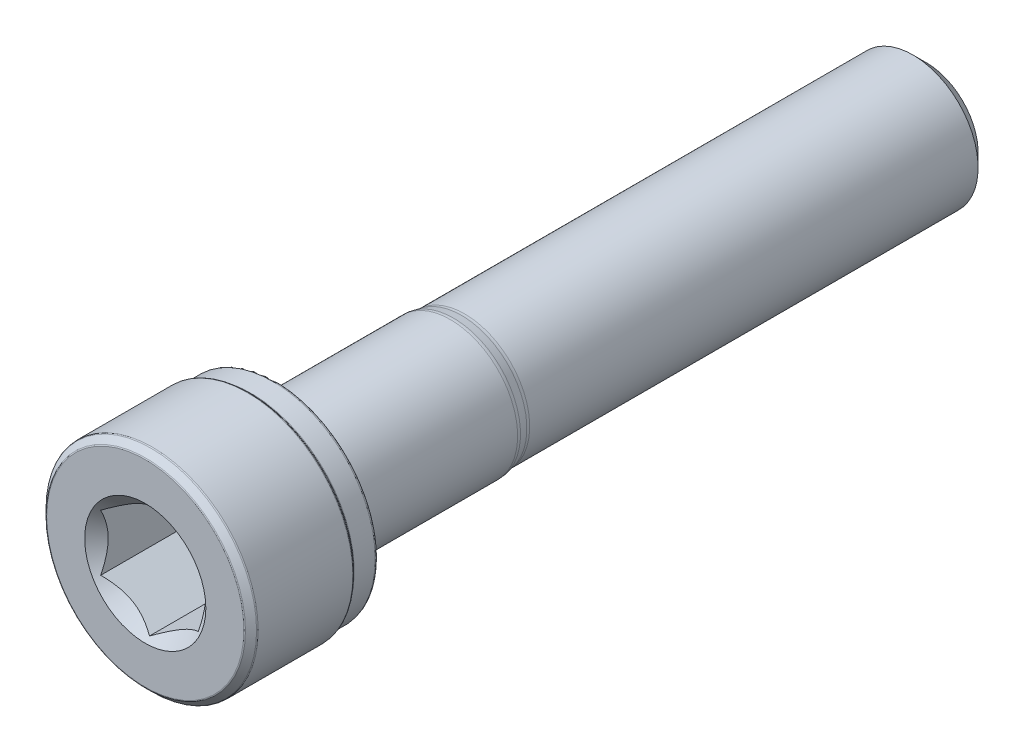
ISO-10303-21;
HEADER;
FILE_DESCRIPTION(('STEP AP214'),'2;1');
FILE_NAME('part.step','',(''),(''),'','','');
FILE_SCHEMA(('AUTOMOTIVE_DESIGN { 1 0 10303 214 1 1 1 1 }'));
ENDSEC;
DATA;
#1=APPLICATION_CONTEXT('core data for automotive mechanical design processes');
#2=APPLICATION_PROTOCOL_DEFINITION('international standard','automotive_design',2000,#1);
#3=PRODUCT_CONTEXT('',#1,'mechanical');
#4=PRODUCT('Part','Part','',(#3));
#5=PRODUCT_RELATED_PRODUCT_CATEGORY('part','',(#4));
#6=PRODUCT_DEFINITION_FORMATION('','',#4);
#7=PRODUCT_DEFINITION_CONTEXT('part definition',#1,'design');
#8=PRODUCT_DEFINITION('design','',#6,#7);
#9=PRODUCT_DEFINITION_SHAPE('','',#8);
#10=(LENGTH_UNIT() NAMED_UNIT(*) SI_UNIT(.MILLI.,.METRE.));
#11=(NAMED_UNIT(*) PLANE_ANGLE_UNIT() SI_UNIT($,.RADIAN.));
#12=(NAMED_UNIT(*) SI_UNIT($,.STERADIAN.) SOLID_ANGLE_UNIT());
#13=UNCERTAINTY_MEASURE_WITH_UNIT(LENGTH_MEASURE(1.E-05),#10,'distance_accuracy_value','');
#14=(GEOMETRIC_REPRESENTATION_CONTEXT(3) GLOBAL_UNCERTAINTY_ASSIGNED_CONTEXT((#13)) GLOBAL_UNIT_ASSIGNED_CONTEXT((#10,
#11,#12)) REPRESENTATION_CONTEXT('',''));
#15=CARTESIAN_POINT('',(0.,0.,0.));
#16=DIRECTION('',(0.,0.,1.));
#17=DIRECTION('',(1.,0.,0.));
#18=AXIS2_PLACEMENT_3D('',#15,#16,#17);
#19=CARTESIAN_POINT('',(0.,3.18810118395208,-24.));
#20=DIRECTION('',(0.,0.,-1.));
#21=DIRECTION('',(-1.,0.,0.));
#22=AXIS2_PLACEMENT_3D('',#19,#20,#21);
#23=PLANE('',#22);
#24=CARTESIAN_POINT('',(0.,0.,-24.));
#25=DIRECTION('',(0.,0.,-1.));
#26=DIRECTION('',(-1.,0.,0.));
#27=AXIS2_PLACEMENT_3D('',#24,#25,#26);
#28=CIRCLE('',#27,3.18810118395208);
#29=CARTESIAN_POINT('',(-3.18810118395208,0.,-24.));
#30=VERTEX_POINT('',#29);
#31=EDGE_CURVE('E56',#30,#30,#28,.T.);
#32=ORIENTED_EDGE('',*,*,#31,.T.);
#33=EDGE_LOOP('',(#32));
#34=FACE_BOUND('',#33,.T.);
#35=ADVANCED_FACE('F42',(#34),#23,.T.);
#36=CARTESIAN_POINT('',(0.,0.,-24.));
#37=DIRECTION('',(0.,0.,1.));
#38=DIRECTION('',(1.,0.,0.));
#39=AXIS2_PLACEMENT_3D('',#36,#37,#38);
#40=CONICAL_SURFACE('',#39,3.18810118395208,0.785398163397444);
#41=CARTESIAN_POINT('',(0.,0.,-23.1881011839521));
#42=DIRECTION('',(0.,0.,-1.));
#43=DIRECTION('',(-1.,0.,0.));
#44=AXIS2_PLACEMENT_3D('',#41,#42,#43);
#45=CIRCLE('',#44,4.);
#46=CARTESIAN_POINT('',(-4.,0.,-23.1881011839521));
#47=VERTEX_POINT('',#46);
#48=EDGE_CURVE('E214',#47,#47,#45,.T.);
#49=ORIENTED_EDGE('',*,*,#48,.T.);
#50=EDGE_LOOP('',(#49));
#51=FACE_BOUND('',#50,.T.);
#52=ORIENTED_EDGE('',*,*,#31,.F.);
#53=EDGE_LOOP('',(#52));
#54=FACE_BOUND('',#53,.T.);
#55=ADVANCED_FACE('F222',(#51,#54),#40,.T.);
#56=CARTESIAN_POINT('',(0.,0.,-24.));
#57=DIRECTION('',(0.,0.,-1.));
#58=DIRECTION('',(-1.,0.,0.));
#59=AXIS2_PLACEMENT_3D('',#56,#57,#58);
#60=CYLINDRICAL_SURFACE('',#59,4.);
#61=CARTESIAN_POINT('',(0.,0.,4.37025859664283));
#62=DIRECTION('',(0.,0.,-1.));
#63=DIRECTION('',(-1.,0.,0.));
#64=AXIS2_PLACEMENT_3D('',#61,#62,#63);
#65=CIRCLE('',#64,4.);
#66=CARTESIAN_POINT('',(-4.,0.,4.37025859664283));
#67=VERTEX_POINT('',#66);
#68=EDGE_CURVE('E210',#67,#67,#65,.T.);
#69=ORIENTED_EDGE('',*,*,#68,.T.);
#70=EDGE_LOOP('',(#69));
#71=FACE_BOUND('',#70,.T.);
#72=ORIENTED_EDGE('',*,*,#48,.F.);
#73=EDGE_LOOP('',(#72));
#74=FACE_BOUND('',#73,.T.);
#75=ADVANCED_FACE('F224',(#71,#74),#60,.T.);
#76=CARTESIAN_POINT('',(0.,0.,4.37025859664284));
#77=DIRECTION('',(0.,0.,-1.));
#78=DIRECTION('',(-1.,0.,0.));
#79=AXIS2_PLACEMENT_3D('',#76,#77,#78);
#80=TOROIDAL_SURFACE('',#79,5.,1.);
#81=CARTESIAN_POINT('',(0.,0.,4.56534891865896));
#82=DIRECTION('',(0.,0.,-1.));
#83=DIRECTION('',(-1.,0.,0.));
#84=AXIS2_PLACEMENT_3D('',#81,#82,#83);
#85=CIRCLE('',#84,4.01921471959677);
#86=CARTESIAN_POINT('',(-4.01921471959677,0.,4.56534891865896));
#87=VERTEX_POINT('',#86);
#88=EDGE_CURVE('E206',#87,#87,#85,.T.);
#89=ORIENTED_EDGE('',*,*,#88,.T.);
#90=EDGE_LOOP('',(#89));
#91=FACE_BOUND('',#90,.T.);
#92=ORIENTED_EDGE('',*,*,#68,.F.);
#93=EDGE_LOOP('',(#92));
#94=FACE_BOUND('',#93,.T.);
#95=ADVANCED_FACE('F230',(#91,#94),#80,.F.);
#96=CARTESIAN_POINT('',(0.,0.,4.56534891865896));
#97=DIRECTION('',(0.,0.,1.));
#98=DIRECTION('',(1.,0.,0.));
#99=AXIS2_PLACEMENT_3D('',#96,#97,#98);
#100=CONICAL_SURFACE('',#99,4.01921471959677,0.196349540849362);
#101=CARTESIAN_POINT('',(0.,0.,5.05243291159565));
#102=DIRECTION('',(0.,0.,-1.));
#103=DIRECTION('',(-1.,0.,0.));
#104=AXIS2_PLACEMENT_3D('',#101,#102,#103);
#105=CIRCLE('',#104,4.11610174974455);
#106=CARTESIAN_POINT('',(-4.11610174974455,0.,5.05243291159565));
#107=VERTEX_POINT('',#106);
#108=EDGE_CURVE('E202',#107,#107,#105,.T.);
#109=ORIENTED_EDGE('',*,*,#108,.T.);
#110=EDGE_LOOP('',(#109));
#111=FACE_BOUND('',#110,.T.);
#112=ORIENTED_EDGE('',*,*,#88,.F.);
#113=EDGE_LOOP('',(#112));
#114=FACE_BOUND('',#113,.T.);
#115=ADVANCED_FACE('F236',(#111,#114),#100,.T.);
#116=CARTESIAN_POINT('',(0.,0.,5.24752323361178));
#117=DIRECTION('',(0.,0.,-1.));
#118=DIRECTION('',(-1.,0.,0.));
#119=AXIS2_PLACEMENT_3D('',#116,#117,#118);
#120=TOROIDAL_SURFACE('',#119,3.13531646934131,1.);
#121=CARTESIAN_POINT('',(0.,0.,5.24752323361178));
#122=DIRECTION('',(0.,0.,-1.));
#123=DIRECTION('',(-1.,0.,0.));
#124=AXIS2_PLACEMENT_3D('',#121,#122,#123);
#125=CIRCLE('',#124,4.13531646934131);
#126=CARTESIAN_POINT('',(-4.13531646934131,0.,5.24752323361178));
#127=VERTEX_POINT('',#126);
#128=EDGE_CURVE('E198',#127,#127,#125,.T.);
#129=ORIENTED_EDGE('',*,*,#128,.T.);
#130=EDGE_LOOP('',(#129));
#131=FACE_BOUND('',#130,.T.);
#132=ORIENTED_EDGE('',*,*,#108,.F.);
#133=EDGE_LOOP('',(#132));
#134=FACE_BOUND('',#133,.T.);
#135=ADVANCED_FACE('F240',(#131,#134),#120,.T.);
#136=CARTESIAN_POINT('',(0.,0.,-24.));
#137=DIRECTION('',(0.,0.,-1.));
#138=DIRECTION('',(-1.,0.,0.));
#139=AXIS2_PLACEMENT_3D('',#136,#137,#138);
#140=CYLINDRICAL_SURFACE('',#139,4.13531646934131);
#141=CARTESIAN_POINT('',(0.,0.,15.6));
#142=DIRECTION('',(0.,0.,-1.));
#143=DIRECTION('',(-1.,0.,0.));
#144=AXIS2_PLACEMENT_3D('',#141,#142,#143);
#145=CIRCLE('',#144,4.13531646934132);
#146=CARTESIAN_POINT('',(-4.13531646934132,0.,15.6));
#147=VERTEX_POINT('',#146);
#148=EDGE_CURVE('E194',#147,#147,#145,.T.);
#149=ORIENTED_EDGE('',*,*,#148,.T.);
#150=EDGE_LOOP('',(#149));
#151=FACE_BOUND('',#150,.T.);
#152=ORIENTED_EDGE('',*,*,#128,.F.);
#153=EDGE_LOOP('',(#152));
#154=FACE_BOUND('',#153,.T.);
#155=ADVANCED_FACE('F244',(#151,#154),#140,.T.);
#156=CARTESIAN_POINT('',(0.,0.,15.6));
#157=DIRECTION('',(0.,0.,-1.));
#158=DIRECTION('',(-1.,0.,0.));
#159=AXIS2_PLACEMENT_3D('',#156,#157,#158);
#160=TOROIDAL_SURFACE('',#159,4.53531646934131,0.399999999999999);
#161=CARTESIAN_POINT('',(0.,0.,16.));
#162=DIRECTION('',(0.,0.,-1.));
#163=DIRECTION('',(-1.,0.,0.));
#164=AXIS2_PLACEMENT_3D('',#161,#162,#163);
#165=CIRCLE('',#164,4.53531646934131);
#166=CARTESIAN_POINT('',(-4.53531646934131,0.,16.));
#167=VERTEX_POINT('',#166);
#168=EDGE_CURVE('E190',#167,#167,#165,.T.);
#169=ORIENTED_EDGE('',*,*,#168,.T.);
#170=EDGE_LOOP('',(#169));
#171=FACE_BOUND('',#170,.T.);
#172=ORIENTED_EDGE('',*,*,#148,.F.);
#173=EDGE_LOOP('',(#172));
#174=FACE_BOUND('',#173,.T.);
#175=ADVANCED_FACE('F248',(#171,#174),#160,.F.);
#176=CARTESIAN_POINT('',(0.,6.1375,16.));
#177=DIRECTION('',(0.,0.,-1.));
#178=DIRECTION('',(-1.,0.,0.));
#179=AXIS2_PLACEMENT_3D('',#176,#177,#178);
#180=PLANE('',#179);
#181=CARTESIAN_POINT('',(0.,0.,16.));
#182=DIRECTION('',(0.,0.,-1.));
#183=DIRECTION('',(-1.,0.,0.));
#184=AXIS2_PLACEMENT_3D('',#181,#182,#183);
#185=CIRCLE('',#184,6.1375);
#186=CARTESIAN_POINT('',(-6.1375,0.,16.));
#187=VERTEX_POINT('',#186);
#188=EDGE_CURVE('E186',#187,#187,#185,.T.);
#189=ORIENTED_EDGE('',*,*,#188,.T.);
#190=EDGE_LOOP('',(#189));
#191=FACE_BOUND('',#190,.T.);
#192=ORIENTED_EDGE('',*,*,#168,.F.);
#193=EDGE_LOOP('',(#192));
#194=FACE_BOUND('',#193,.T.);
#195=ADVANCED_FACE('F252',(#191,#194),#180,.T.);
#196=CARTESIAN_POINT('',(0.,0.,16.1625));
#197=DIRECTION('',(0.,0.,-1.));
#198=DIRECTION('',(-1.,0.,0.));
#199=AXIS2_PLACEMENT_3D('',#196,#197,#198);
#200=TOROIDAL_SURFACE('',#199,6.1375,0.1625);
#201=CARTESIAN_POINT('',(0.,0.,16.1625));
#202=DIRECTION('',(0.,0.,-1.));
#203=DIRECTION('',(-1.,0.,0.));
#204=AXIS2_PLACEMENT_3D('',#201,#202,#203);
#205=CIRCLE('',#204,6.3);
#206=CARTESIAN_POINT('',(-6.3,0.,16.1625));
#207=VERTEX_POINT('',#206);
#208=EDGE_CURVE('E182',#207,#207,#205,.T.);
#209=ORIENTED_EDGE('',*,*,#208,.T.);
#210=EDGE_LOOP('',(#209));
#211=FACE_BOUND('',#210,.T.);
#212=ORIENTED_EDGE('',*,*,#188,.F.);
#213=EDGE_LOOP('',(#212));
#214=FACE_BOUND('',#213,.T.);
#215=ADVANCED_FACE('F256',(#211,#214),#200,.T.);
#216=CARTESIAN_POINT('',(0.,0.,-24.));
#217=DIRECTION('',(0.,0.,-1.));
#218=DIRECTION('',(-1.,0.,0.));
#219=AXIS2_PLACEMENT_3D('',#216,#217,#218);
#220=CYLINDRICAL_SURFACE('',#219,6.3);
#221=CARTESIAN_POINT('',(0.,0.,17.4585786437627));
#222=DIRECTION('',(0.,0.,-1.));
#223=DIRECTION('',(-1.,0.,0.));
#224=AXIS2_PLACEMENT_3D('',#221,#222,#223);
#225=CIRCLE('',#224,6.3);
#226=CARTESIAN_POINT('',(-6.3,0.,17.4585786437627));
#227=VERTEX_POINT('',#226);
#228=EDGE_CURVE('E178',#227,#227,#225,.T.);
#229=ORIENTED_EDGE('',*,*,#228,.T.);
#230=EDGE_LOOP('',(#229));
#231=FACE_BOUND('',#230,.T.);
#232=ORIENTED_EDGE('',*,*,#208,.F.);
#233=EDGE_LOOP('',(#232));
#234=FACE_BOUND('',#233,.T.);
#235=ADVANCED_FACE('F260',(#231,#234),#220,.T.);
#236=CARTESIAN_POINT('',(0.,0.,17.4585786437627));
#237=DIRECTION('',(0.,0.,-1.));
#238=DIRECTION('',(-1.,0.,0.));
#239=AXIS2_PLACEMENT_3D('',#236,#237,#238);
#240=TOROIDAL_SURFACE('',#239,6.4,0.0999999999999989);
#241=CARTESIAN_POINT('',(0.,0.,17.5292893218813));
#242=DIRECTION('',(0.,0.,-1.));
#243=DIRECTION('',(-1.,0.,0.));
#244=AXIS2_PLACEMENT_3D('',#241,#242,#243);
#245=CIRCLE('',#244,6.32928932188135);
#246=CARTESIAN_POINT('',(-6.32928932188135,0.,17.5292893218813));
#247=VERTEX_POINT('',#246);
#248=EDGE_CURVE('E174',#247,#247,#245,.T.);
#249=ORIENTED_EDGE('',*,*,#248,.T.);
#250=EDGE_LOOP('',(#249));
#251=FACE_BOUND('',#250,.T.);
#252=ORIENTED_EDGE('',*,*,#228,.F.);
#253=EDGE_LOOP('',(#252));
#254=FACE_BOUND('',#253,.T.);
#255=ADVANCED_FACE('F264',(#251,#254),#240,.F.);
#256=CARTESIAN_POINT('',(0.,0.,17.5292893218813));
#257=DIRECTION('',(0.,0.,1.));
#258=DIRECTION('',(1.,0.,0.));
#259=AXIS2_PLACEMENT_3D('',#256,#257,#258);
#260=CONICAL_SURFACE('',#259,6.32928932188135,0.785398163397451);
#261=CARTESIAN_POINT('',(0.,0.,17.6707106781187));
#262=DIRECTION('',(0.,0.,-1.));
#263=DIRECTION('',(-1.,0.,0.));
#264=AXIS2_PLACEMENT_3D('',#261,#262,#263);
#265=CIRCLE('',#264,6.47071067811865);
#266=CARTESIAN_POINT('',(-6.47071067811865,0.,17.6707106781187));
#267=VERTEX_POINT('',#266);
#268=EDGE_CURVE('E170',#267,#267,#265,.T.);
#269=ORIENTED_EDGE('',*,*,#268,.T.);
#270=EDGE_LOOP('',(#269));
#271=FACE_BOUND('',#270,.T.);
#272=ORIENTED_EDGE('',*,*,#248,.F.);
#273=EDGE_LOOP('',(#272));
#274=FACE_BOUND('',#273,.T.);
#275=ADVANCED_FACE('F268',(#271,#274),#260,.T.);
#276=CARTESIAN_POINT('',(0.,0.,17.7414213562373));
#277=DIRECTION('',(0.,0.,-1.));
#278=DIRECTION('',(-1.,0.,0.));
#279=AXIS2_PLACEMENT_3D('',#276,#277,#278);
#280=TOROIDAL_SURFACE('',#279,6.4,0.0999999999999994);
#281=CARTESIAN_POINT('',(0.,0.,17.7414213562373));
#282=DIRECTION('',(0.,0.,-1.));
#283=DIRECTION('',(-1.,0.,0.));
#284=AXIS2_PLACEMENT_3D('',#281,#282,#283);
#285=CIRCLE('',#284,6.5);
#286=CARTESIAN_POINT('',(-6.5,0.,17.7414213562373));
#287=VERTEX_POINT('',#286);
#288=EDGE_CURVE('E166',#287,#287,#285,.T.);
#289=ORIENTED_EDGE('',*,*,#288,.T.);
#290=EDGE_LOOP('',(#289));
#291=FACE_BOUND('',#290,.T.);
#292=ORIENTED_EDGE('',*,*,#268,.F.);
#293=EDGE_LOOP('',(#292));
#294=FACE_BOUND('',#293,.T.);
#295=ADVANCED_FACE('F272',(#291,#294),#280,.T.);
#296=CARTESIAN_POINT('',(0.,0.,-24.));
#297=DIRECTION('',(0.,0.,-1.));
#298=DIRECTION('',(-1.,0.,0.));
#299=AXIS2_PLACEMENT_3D('',#296,#297,#298);
#300=CYLINDRICAL_SURFACE('',#299,6.5);
#301=CARTESIAN_POINT('',(0.,0.,23.5585786437627));
#302=DIRECTION('',(0.,0.,-1.));
#303=DIRECTION('',(-1.,0.,0.));
#304=AXIS2_PLACEMENT_3D('',#301,#302,#303);
#305=CIRCLE('',#304,6.5);
#306=CARTESIAN_POINT('',(-6.5,0.,23.5585786437627));
#307=VERTEX_POINT('',#306);
#308=EDGE_CURVE('E162',#307,#307,#305,.T.);
#309=ORIENTED_EDGE('',*,*,#308,.T.);
#310=EDGE_LOOP('',(#309));
#311=FACE_BOUND('',#310,.T.);
#312=ORIENTED_EDGE('',*,*,#288,.F.);
#313=EDGE_LOOP('',(#312));
#314=FACE_BOUND('',#313,.T.);
#315=ADVANCED_FACE('F276',(#311,#314),#300,.T.);
#316=CARTESIAN_POINT('',(0.,0.,23.5585786437627));
#317=DIRECTION('',(0.,0.,-1.));
#318=DIRECTION('',(-1.,0.,0.));
#319=AXIS2_PLACEMENT_3D('',#316,#317,#318);
#320=TOROIDAL_SURFACE('',#319,6.4,0.0999999999999991);
#321=CARTESIAN_POINT('',(0.,0.,23.6292893218813));
#322=DIRECTION('',(0.,0.,-1.));
#323=DIRECTION('',(-1.,0.,0.));
#324=AXIS2_PLACEMENT_3D('',#321,#322,#323);
#325=CIRCLE('',#324,6.47071067811865);
#326=CARTESIAN_POINT('',(-6.47071067811865,0.,23.6292893218813));
#327=VERTEX_POINT('',#326);
#328=EDGE_CURVE('E158',#327,#327,#325,.T.);
#329=ORIENTED_EDGE('',*,*,#328,.T.);
#330=EDGE_LOOP('',(#329));
#331=FACE_BOUND('',#330,.T.);
#332=ORIENTED_EDGE('',*,*,#308,.F.);
#333=EDGE_LOOP('',(#332));
#334=FACE_BOUND('',#333,.T.);
#335=ADVANCED_FACE('F280',(#331,#334),#320,.T.);
#336=CARTESIAN_POINT('',(0.,0.,23.6292893218813));
#337=DIRECTION('',(0.,0.,-1.));
#338=DIRECTION('',(-1.,0.,0.));
#339=AXIS2_PLACEMENT_3D('',#336,#337,#338);
#340=CONICAL_SURFACE('',#339,6.47071067811865,0.785398163397443);
#341=CARTESIAN_POINT('',(0.,0.,23.9707106781187));
#342=DIRECTION('',(0.,0.,-1.));
#343=DIRECTION('',(-1.,0.,0.));
#344=AXIS2_PLACEMENT_3D('',#341,#342,#343);
#345=CIRCLE('',#344,6.12928932188135);
#346=CARTESIAN_POINT('',(-6.12928932188135,0.,23.9707106781187));
#347=VERTEX_POINT('',#346);
#348=EDGE_CURVE('E154',#347,#347,#345,.T.);
#349=ORIENTED_EDGE('',*,*,#348,.T.);
#350=EDGE_LOOP('',(#349));
#351=FACE_BOUND('',#350,.T.);
#352=ORIENTED_EDGE('',*,*,#328,.F.);
#353=EDGE_LOOP('',(#352));
#354=FACE_BOUND('',#353,.T.);
#355=ADVANCED_FACE('F284',(#351,#354),#340,.T.);
#356=CARTESIAN_POINT('',(0.,0.,23.9));
#357=DIRECTION('',(0.,0.,-1.));
#358=DIRECTION('',(-1.,0.,0.));
#359=AXIS2_PLACEMENT_3D('',#356,#357,#358);
#360=TOROIDAL_SURFACE('',#359,6.05857864376269,0.0999999999999991);
#361=CARTESIAN_POINT('',(0.,0.,24.));
#362=DIRECTION('',(0.,0.,-1.));
#363=DIRECTION('',(-1.,0.,0.));
#364=AXIS2_PLACEMENT_3D('',#361,#362,#363);
#365=CIRCLE('',#364,6.05857864376269);
#366=CARTESIAN_POINT('',(-6.05857864376269,0.,24.));
#367=VERTEX_POINT('',#366);
#368=EDGE_CURVE('E150',#367,#367,#365,.T.);
#369=ORIENTED_EDGE('',*,*,#368,.T.);
#370=EDGE_LOOP('',(#369));
#371=FACE_BOUND('',#370,.T.);
#372=ORIENTED_EDGE('',*,*,#348,.F.);
#373=EDGE_LOOP('',(#372));
#374=FACE_BOUND('',#373,.T.);
#375=ADVANCED_FACE('F288',(#371,#374),#360,.T.);
#376=CARTESIAN_POINT('',(0.,0.,24.));
#377=DIRECTION('',(0.,0.,1.));
#378=DIRECTION('',(1.,0.,0.));
#379=AXIS2_PLACEMENT_3D('',#376,#377,#378);
#380=PLANE('',#379);
#381=CARTESIAN_POINT('',(0.,0.,24.));
#382=DIRECTION('',(0.,0.,1.));
#383=DIRECTION('',(1.,0.,0.));
#384=AXIS2_PLACEMENT_3D('',#381,#382,#383);
#385=CIRCLE('',#384,3.72390923627308);
#386=CARTESIAN_POINT('',(3.72390923627308,0.,24.));
#387=VERTEX_POINT('',#386);
#388=EDGE_CURVE('E116',#387,#387,#385,.T.);
#389=ORIENTED_EDGE('',*,*,#388,.F.);
#390=EDGE_LOOP('',(#389));
#391=FACE_BOUND('',#390,.T.);
#392=ORIENTED_EDGE('',*,*,#368,.F.);
#393=EDGE_LOOP('',(#392));
#394=FACE_BOUND('',#393,.T.);
#395=ADVANCED_FACE('F292',(#391,#394),#380,.T.);
#396=CARTESIAN_POINT('',(0.,0.,24.));
#397=DIRECTION('',(0.,0.,1.));
#398=DIRECTION('',(1.,0.,0.));
#399=AXIS2_PLACEMENT_3D('',#396,#397,#398);
#400=CONICAL_SURFACE('',#399,3.72390923627308,0.78539816339745);
#401=ORIENTED_EDGE('',*,*,#388,.T.);
#402=EDGE_LOOP('',(#401));
#403=FACE_BOUND('',#402,.T.);
#404=CARTESIAN_POINT('',(-0.000199999999999184,-3.46421708519159,23.7403078546918));
#405=CARTESIAN_POINT('',(0.102923514955749,-3.40467869607211,23.6808206971865));
#406=CARTESIAN_POINT('',(0.207771389330651,-3.3441447475778,23.6248273583302));
#407=CARTESIAN_POINT('',(0.421567671781097,-3.22070940635329,23.5223049752436));
#408=CARTESIAN_POINT('',(0.530536411379761,-3.15779627521275,23.475832972606));
#409=CARTESIAN_POINT('',(0.750266639597029,-3.03093496880241,23.396225567381));
#410=CARTESIAN_POINT('',(0.860972171762212,-2.96701910000606,23.3628900795073));
#411=CARTESIAN_POINT('',(1.08482041056533,-2.83778025907546,23.311529922844));
#412=CARTESIAN_POINT('',(1.19795627920699,-2.77246123486019,23.2934669164003));
#413=CARTESIAN_POINT('',(1.3929409561927,-2.65988677911464,23.2771692873152));
#414=CARTESIAN_POINT('',(1.47453795400213,-2.6127767304643,23.2747567460385));
#415=CARTESIAN_POINT('',(1.63759922883009,-2.51863325954797,23.2788218135218));
#416=CARTESIAN_POINT('',(1.71906344929899,-2.47159986993093,23.285302538893));
#417=CARTESIAN_POINT('',(1.88122011233837,-2.37797867687425,23.3067841013799));
#418=CARTESIAN_POINT('',(1.9619115887843,-2.33139143122689,23.3217944688319));
#419=CARTESIAN_POINT('',(2.12190869789134,-2.23901705721438,23.3595160249307));
#420=CARTESIAN_POINT('',(2.2012144363093,-2.19322986779049,23.3822266231875));
#421=CARTESIAN_POINT('',(2.34200614080275,-2.11194373930152,23.4289530637186));
#422=CARTESIAN_POINT('',(2.40380372214602,-2.07626488907772,23.4517407065455));
#423=CARTESIAN_POINT('',(2.52628941752022,-2.00554773988155,23.5009886649221));
#424=CARTESIAN_POINT('',(2.5869774976356,-1.97050946049033,23.5274490925309));
#425=CARTESIAN_POINT('',(2.70705299739086,-1.90118383838355,23.583449373256));
#426=CARTESIAN_POINT('',(2.76644383229592,-1.86689452386372,23.612979543343));
#427=CARTESIAN_POINT('',(2.88412556146727,-1.79895094584794,23.6747314704402));
#428=CARTESIAN_POINT('',(2.94241710424773,-1.76529630793216,23.706951575524));
#429=CARTESIAN_POINT('',(3.0002,-1.73193533751503,23.7403078546918));
#430=B_SPLINE_CURVE_WITH_KNOTS('',3,(#404,#405,#406,#407,#408,#409,#410,#411,#412,#413,#414,
#415,#416,#417,#418,#419,#420,#421,#422,#423,#424,#425,#426,#427,#428,#429),.UNSPECIFIED.,.F.,
.F.,(4,2,2,2,2,2,2,2,2,2,2,2,4),(0.,0.399603557139309,0.801535286397846,1.19708369162343,
1.59163620080173,1.87398941755844,2.15644160919093,2.43921001247425,2.72195674032138,
2.94657516661926,3.17120044767274,3.3951375283781,3.61893808380739),.UNSPECIFIED.);
#431=CARTESIAN_POINT('',(0.,-3.46410161513775,23.7401923788647));
#432=VERTEX_POINT('',#431);
#433=CARTESIAN_POINT('',(3.,-1.73205080756887,23.7401923788647));
#434=VERTEX_POINT('',#433);
#435=EDGE_CURVE('E13',#432,#434,#430,.T.);
#436=ORIENTED_EDGE('',*,*,#435,.F.);
#437=CARTESIAN_POINT('',(-3.0002,-1.73193533751504,23.7403078546918));
#438=CARTESIAN_POINT('',(-2.89707648504425,-1.79147372663452,23.6808206971865));
#439=CARTESIAN_POINT('',(-2.79222861066935,-1.85200767512883,23.6248273583302));
#440=CARTESIAN_POINT('',(-2.5784323282189,-1.97544301635333,23.5223049752436));
#441=CARTESIAN_POINT('',(-2.46946358862024,-2.03835614749388,23.475832972606));
#442=CARTESIAN_POINT('',(-2.24973336040297,-2.16521745390421,23.396225567381));
#443=CARTESIAN_POINT('',(-2.13902782823779,-2.22913332270056,23.3628900795073));
#444=CARTESIAN_POINT('',(-1.91517958943467,-2.35837216363117,23.311529922844));
#445=CARTESIAN_POINT('',(-1.802043720793,-2.42369118784643,23.2934669164003));
#446=CARTESIAN_POINT('',(-1.6070590438073,-2.53626564359199,23.2771692873152));
#447=CARTESIAN_POINT('',(-1.52546204599786,-2.58337569224233,23.2747567460385));
#448=CARTESIAN_POINT('',(-1.36240077116991,-2.67751916315865,23.2788218135218));
#449=CARTESIAN_POINT('',(-1.28093655070101,-2.72455255277569,23.285302538893));
#450=CARTESIAN_POINT('',(-1.11877988766163,-2.81817374583237,23.3067841013799));
#451=CARTESIAN_POINT('',(-1.03808841121569,-2.86476099147974,23.3217944688319));
#452=CARTESIAN_POINT('',(-0.878091302108662,-2.95713536549224,23.3595160249307));
#453=CARTESIAN_POINT('',(-0.798785563690701,-3.00292255491614,23.3822266231875));
#454=CARTESIAN_POINT('',(-0.657993859197245,-3.0842086834051,23.4289530637186));
#455=CARTESIAN_POINT('',(-0.596196277853973,-3.11988753362891,23.4517407065455));
#456=CARTESIAN_POINT('',(-0.473710582479779,-3.19060468282507,23.5009886649221));
#457=CARTESIAN_POINT('',(-0.413022502364395,-3.22564296221629,23.5274490925309));
#458=CARTESIAN_POINT('',(-0.292947002609134,-3.29496858432307,23.583449373256));
#459=CARTESIAN_POINT('',(-0.233556167704079,-3.3292578988429,23.612979543343));
#460=CARTESIAN_POINT('',(-0.115874438532729,-3.39720147685868,23.6747314704402));
#461=CARTESIAN_POINT('',(-0.0575828957522639,-3.43085611477446,23.706951575524));
#462=CARTESIAN_POINT('',(0.000200000000001762,-3.46421708519159,23.7403078546918));
#463=B_SPLINE_CURVE_WITH_KNOTS('',3,(#437,#438,#439,#440,#441,#442,#443,#444,#445,#446,#447,
#448,#449,#450,#451,#452,#453,#454,#455,#456,#457,#458,#459,#460,#461,#462),.UNSPECIFIED.,.F.,
.F.,(4,2,2,2,2,2,2,2,2,2,2,2,4),(0.,0.399603557139306,0.801535286397847,1.19708369162343,
1.59163620080173,1.87398941755844,2.15644160919093,2.43921001247425,2.72195674032138,
2.94657516661926,3.17120044767274,3.3951375283781,3.61893808380739),.UNSPECIFIED.);
#464=CARTESIAN_POINT('',(-3.,-1.73205080756887,23.7401923788647));
#465=VERTEX_POINT('',#464);
#466=EDGE_CURVE('E101',#465,#432,#463,.T.);
#467=ORIENTED_EDGE('',*,*,#466,.F.);
#468=CARTESIAN_POINT('',(-3.,-3.63597263369801,24.9899317658186));
#469=CARTESIAN_POINT('',(-3.,-3.54821081453762,24.9222527639653));
#470=CARTESIAN_POINT('',(-3.,-3.45997854995776,24.8551742635189));
#471=CARTESIAN_POINT('',(-3.,-3.28237997949551,24.7224933181335));
#472=CARTESIAN_POINT('',(-3.,-3.19301341225036,24.6568912234072));
#473=CARTESIAN_POINT('',(-3.,-3.01230028902466,24.526971369594));
#474=CARTESIAN_POINT('',(-3.,-2.92094378054021,24.462667408983));
#475=CARTESIAN_POINT('',(-3.,-2.73671453430276,24.3362769746898));
#476=CARTESIAN_POINT('',(-3.,-2.64384190127937,24.274190348777));
#477=CARTESIAN_POINT('',(-3.,-2.45029951749767,24.1488396249979));
#478=CARTESIAN_POINT('',(-3.,-2.34951218319449,24.0857561674871));
#479=CARTESIAN_POINT('',(-3.,-2.14556933396837,23.9634753027544));
#480=CARTESIAN_POINT('',(-3.,-2.04241342144356,23.9042785545085));
#481=CARTESIAN_POINT('',(-3.,-1.83370026413672,23.7910295461651));
#482=CARTESIAN_POINT('',(-3.,-1.72815127460949,23.7369621909277));
#483=CARTESIAN_POINT('',(-3.,-1.51405629629858,23.635183407377));
#484=CARTESIAN_POINT('',(-3.,-1.40551175824851,23.5874689653898));
#485=CARTESIAN_POINT('',(-3.,-1.1962992758153,23.5045378495382));
#486=CARTESIAN_POINT('',(-3.,-1.09594180146237,23.4685458924784));
#487=CARTESIAN_POINT('',(-3.,-0.892651828129793,23.4045932060893));
#488=CARTESIAN_POINT('',(-3.,-0.789719167141592,23.3766329834358));
#489=CARTESIAN_POINT('',(-3.,-0.583697290901955,23.3307307883211));
#490=CARTESIAN_POINT('',(-3.,-0.480649626339327,23.3126054725429));
#491=CARTESIAN_POINT('',(-3.,-0.273250769977056,23.2867543887194));
#492=CARTESIAN_POINT('',(-3.,-0.168899860014967,23.2790264101634));
#493=CARTESIAN_POINT('',(-3.,0.0353613814991982,23.2746391860521));
#494=CARTESIAN_POINT('',(-3.,0.135261478415164,23.2775001300684));
#495=CARTESIAN_POINT('',(-3.,0.334290885877441,23.2930266368826));
#496=CARTESIAN_POINT('',(-3.,0.433420126307056,23.3056930812866));
#497=CARTESIAN_POINT('',(-3.,0.631874596080604,23.3403254397116));
#498=CARTESIAN_POINT('',(-3.,0.731170585274612,23.3624563348122));
#499=CARTESIAN_POINT('',(-3.,0.927562094571362,23.4147869672083));
#500=CARTESIAN_POINT('',(-3.,1.02465773123986,23.4449862759829));
#501=CARTESIAN_POINT('',(-3.,1.32263484371317,23.5492279624378));
#502=CARTESIAN_POINT('',(-3.,1.51949127420347,23.6348113474384));
#503=CARTESIAN_POINT('',(-3.,1.80760742350502,23.777589656377));
#504=CARTESIAN_POINT('',(-3.,1.90262753095824,23.8276934985151));
#505=CARTESIAN_POINT('',(-3.,2.09051797246354,23.9317906459646));
#506=CARTESIAN_POINT('',(-3.,2.18338867977823,23.9857832691553));
#507=CARTESIAN_POINT('',(-3.,2.36269431772654,24.0941374400834));
#508=CARTESIAN_POINT('',(-3.,2.44922070423858,24.1483493485577));
#509=CARTESIAN_POINT('',(-3.,2.62078869979529,24.2590849027924));
#510=CARTESIAN_POINT('',(-3.,2.70583019698247,24.3156087216473));
#511=CARTESIAN_POINT('',(-3.,2.87393748584989,24.4300950802763));
#512=CARTESIAN_POINT('',(-3.,2.95701365163953,24.4880424502656));
#513=CARTESIAN_POINT('',(-3.,3.12202586462518,24.6054926827478));
#514=CARTESIAN_POINT('',(-3.,3.20396221984363,24.6649951119776));
#515=CARTESIAN_POINT('',(-3.,3.28542059434172,24.7251343105721));
#516=B_SPLINE_CURVE_WITH_KNOTS('',3,(#468,#469,#470,#471,#472,#473,#474,#475,#476,#477,#478,
#479,#480,#481,#482,#483,#484,#485,#486,#487,#488,#489,#490,#491,#492,#493,#494,#495,#496,#497,
#498,#499,#500,#501,#502,#503,#504,#505,#506,#507,#508,#509,#510,#511,#512,#513,#514,#515),
.UNSPECIFIED.,.F.,.F.,(4,2,2,2,2,2,2,2,2,2,2,2,2,2,2,2,2,2,2,2,2,2,2,4),(0.,0.332486500650508,
0.665051055190986,1.00017918858508,1.33528426941216,1.69191962778576,2.04861529694579,
2.40422638996116,2.75966818372677,3.07924217570899,3.39883632334218,3.71224778650697,
4.02559260675559,4.32491644245469,4.62426719328911,4.92906363386979,5.23384388964463,
5.87582449637266,6.19805908905046,6.52023729642129,6.82651951595852,7.13282470921206,
7.4366739083973,7.74043933457839),.UNSPECIFIED.);
#517=CARTESIAN_POINT('',(-3.,1.73205080756887,23.7401923788647));
#518=VERTEX_POINT('',#517);
#519=EDGE_CURVE('E115',#518,#465,#516,.F.);
#520=ORIENTED_EDGE('',*,*,#519,.F.);
#521=CARTESIAN_POINT('',(0.000200000000000802,3.46421708519159,23.7403078546918));
#522=CARTESIAN_POINT('',(-0.102923514955749,3.40467869607211,23.6808206971865));
#523=CARTESIAN_POINT('',(-0.207771389330652,3.3441447475778,23.6248273583302));
#524=CARTESIAN_POINT('',(-0.421567671781099,3.22070940635329,23.5223049752436));
#525=CARTESIAN_POINT('',(-0.530536411379763,3.15779627521275,23.475832972606));
#526=CARTESIAN_POINT('',(-0.750266639597032,3.03093496880241,23.396225567381));
#527=CARTESIAN_POINT('',(-0.860972171762215,2.96701910000606,23.3628900795073));
#528=CARTESIAN_POINT('',(-1.08482041056533,2.83778025907546,23.311529922844));
#529=CARTESIAN_POINT('',(-1.197956279207,2.77246123486019,23.2934669164003));
#530=CARTESIAN_POINT('',(-1.39294095619271,2.65988677911464,23.2771692873152));
#531=CARTESIAN_POINT('',(-1.47453795400214,2.6127767304643,23.2747567460385));
#532=CARTESIAN_POINT('',(-1.63759922883009,2.51863325954797,23.2788218135218));
#533=CARTESIAN_POINT('',(-1.71906344929899,2.47159986993093,23.285302538893));
#534=CARTESIAN_POINT('',(-1.88122011233837,2.37797867687425,23.3067841013799));
#535=CARTESIAN_POINT('',(-1.96191158878431,2.33139143122688,23.321794468832));
#536=CARTESIAN_POINT('',(-2.12190869789134,2.23901705721438,23.3595160249307));
#537=CARTESIAN_POINT('',(-2.2012144363093,2.19322986779048,23.3822266231875));
#538=CARTESIAN_POINT('',(-2.34200614080276,2.11194373930152,23.4289530637186));
#539=CARTESIAN_POINT('',(-2.40380372214603,2.07626488907772,23.4517407065455));
#540=CARTESIAN_POINT('',(-2.52628941752022,2.00554773988155,23.5009886649221));
#541=CARTESIAN_POINT('',(-2.58697749763561,1.97050946049033,23.5274490925309));
#542=CARTESIAN_POINT('',(-2.70705299739086,1.90118383838355,23.583449373256));
#543=CARTESIAN_POINT('',(-2.76644383229592,1.86689452386372,23.612979543343));
#544=CARTESIAN_POINT('',(-2.88412556146727,1.79895094584794,23.6747314704402));
#545=CARTESIAN_POINT('',(-2.94241710424773,1.76529630793216,23.706951575524));
#546=CARTESIAN_POINT('',(-3.0002,1.73193533751504,23.7403078546918));
#547=B_SPLINE_CURVE_WITH_KNOTS('',3,(#521,#522,#523,#524,#525,#526,#527,#528,#529,#530,#531,
#532,#533,#534,#535,#536,#537,#538,#539,#540,#541,#542,#543,#544,#545,#546),.UNSPECIFIED.,.F.,
.F.,(4,2,2,2,2,2,2,2,2,2,2,2,4),(0.,0.39960355713931,0.80153528639785,1.19708369162343,
1.59163620080174,1.87398941755845,2.15644160919093,2.43921001247426,2.72195674032139,
2.94657516661927,3.17120044767275,3.3951375283781,3.61893808380739),.UNSPECIFIED.);
#548=CARTESIAN_POINT('',(0.,3.46410161513775,23.7401923788647));
#549=VERTEX_POINT('',#548);
#550=EDGE_CURVE('E343',#549,#518,#547,.T.);
#551=ORIENTED_EDGE('',*,*,#550,.F.);
#552=CARTESIAN_POINT('',(3.0002,1.73193533751504,23.7403078546918));
#553=CARTESIAN_POINT('',(2.89707648504425,1.79147372663452,23.6808206971865));
#554=CARTESIAN_POINT('',(2.79222861066935,1.85200767512883,23.6248273583302));
#555=CARTESIAN_POINT('',(2.5784323282189,1.97544301635334,23.5223049752436));
#556=CARTESIAN_POINT('',(2.46946358862024,2.03835614749388,23.475832972606));
#557=CARTESIAN_POINT('',(2.24973336040297,2.16521745390422,23.396225567381));
#558=CARTESIAN_POINT('',(2.13902782823779,2.22913332270057,23.3628900795073));
#559=CARTESIAN_POINT('',(1.91517958943467,2.35837216363117,23.311529922844));
#560=CARTESIAN_POINT('',(1.80204372079301,2.42369118784644,23.2934669164003));
#561=CARTESIAN_POINT('',(1.6070590438073,2.53626564359199,23.2771692873152));
#562=CARTESIAN_POINT('',(1.52546204599786,2.58337569224233,23.2747567460385));
#563=CARTESIAN_POINT('',(1.36240077116991,2.67751916315865,23.2788218135218));
#564=CARTESIAN_POINT('',(1.28093655070101,2.72455255277569,23.285302538893));
#565=CARTESIAN_POINT('',(1.11877988766163,2.81817374583237,23.3067841013799));
#566=CARTESIAN_POINT('',(1.0380884112157,2.86476099147974,23.321794468832));
#567=CARTESIAN_POINT('',(0.878091302108662,2.95713536549225,23.3595160249307));
#568=CARTESIAN_POINT('',(0.798785563690701,3.00292255491614,23.3822266231875));
#569=CARTESIAN_POINT('',(0.657993859197245,3.0842086834051,23.4289530637186));
#570=CARTESIAN_POINT('',(0.596196277853972,3.11988753362891,23.4517407065455));
#571=CARTESIAN_POINT('',(0.473710582479779,3.19060468282508,23.5009886649221));
#572=CARTESIAN_POINT('',(0.413022502364395,3.2256429622163,23.5274490925309));
#573=CARTESIAN_POINT('',(0.292947002609136,3.29496858432307,23.583449373256));
#574=CARTESIAN_POINT('',(0.233556167704081,3.3292578988429,23.612979543343));
#575=CARTESIAN_POINT('',(0.115874438532731,3.39720147685868,23.6747314704402));
#576=CARTESIAN_POINT('',(0.0575828957522661,3.43085611477446,23.706951575524));
#577=CARTESIAN_POINT('',(-0.000199999999999184,3.46421708519159,23.7403078546918));
#578=B_SPLINE_CURVE_WITH_KNOTS('',3,(#552,#553,#554,#555,#556,#557,#558,#559,#560,#561,#562,
#563,#564,#565,#566,#567,#568,#569,#570,#571,#572,#573,#574,#575,#576,#577),.UNSPECIFIED.,.F.,
.F.,(4,2,2,2,2,2,2,2,2,2,2,2,4),(0.,0.399603557139309,0.801535286397847,1.19708369162343,
1.59163620080173,1.87398941755845,2.15644160919093,2.43921001247425,2.72195674032138,
2.94657516661927,3.17120044767274,3.3951375283781,3.61893808380739),.UNSPECIFIED.);
#579=CARTESIAN_POINT('',(3.,1.73205080756888,23.7401923788647));
#580=VERTEX_POINT('',#579);
#581=EDGE_CURVE('E316',#580,#549,#578,.T.);
#582=ORIENTED_EDGE('',*,*,#581,.F.);
#583=CARTESIAN_POINT('',(3.,-3.63597288679651,24.9899319610435));
#584=CARTESIAN_POINT('',(3.,-3.54821106030531,24.9222529516296));
#585=CARTESIAN_POINT('',(3.,-3.459978788373,24.8551744436333));
#586=CARTESIAN_POINT('',(3.,-3.28238020313616,24.7224934831912));
#587=CARTESIAN_POINT('',(3.,-3.19301362846884,24.6568913809582));
#588=CARTESIAN_POINT('',(3.,-3.01230049015545,24.5269715120754));
#589=CARTESIAN_POINT('',(3.,-2.92094397400343,24.462667543904));
#590=CARTESIAN_POINT('',(3.,-2.73671471229927,24.3362770946072));
#591=CARTESIAN_POINT('',(3.,-2.64384207147677,24.2741904612511));
#592=CARTESIAN_POINT('',(3.,-2.4502996708564,24.1488397219342));
#593=CARTESIAN_POINT('',(3.,-2.34951232749049,24.0857562563578));
#594=CARTESIAN_POINT('',(3.,-2.14556945981867,23.9634753758581));
#595=CARTESIAN_POINT('',(3.,-2.04241353791073,23.904278619911));
#596=CARTESIAN_POINT('',(3.,-1.8337003615023,23.7910295967959));
#597=CARTESIAN_POINT('',(3.,-1.72815136225939,23.7369622344834));
#598=CARTESIAN_POINT('',(3.,-1.51405636398862,23.6351834376699));
#599=CARTESIAN_POINT('',(3.,-1.40551181569501,23.5874689894939));
#600=CARTESIAN_POINT('',(3.,-1.19629932897774,23.5045378694147));
#601=CARTESIAN_POINT('',(3.,-1.09594186106085,23.4685459131465));
#602=CARTESIAN_POINT('',(3.,-0.892651900852754,23.4045932270499));
#603=CARTESIAN_POINT('',(3.,-0.789719246552726,23.3766330038981));
#604=CARTESIAN_POINT('',(3.,-0.583697383488754,23.3307308062371));
#605=CARTESIAN_POINT('',(3.,-0.480649725408386,23.3126054884554));
#606=CARTESIAN_POINT('',(3.,-0.273250881841222,23.2867543991039));
#607=CARTESIAN_POINT('',(3.,-0.168899978191988,23.2790264170243));
#608=CARTESIAN_POINT('',(3.,0.0353612526515878,23.2746391846889));
#609=CARTESIAN_POINT('',(3.,0.135261345193379,23.2775001241883));
#610=CARTESIAN_POINT('',(3.,0.334290744406011,23.2930266213311));
#611=CARTESIAN_POINT('',(3.,0.433419980960245,23.3056930605799));
#612=CARTESIAN_POINT('',(3.,0.631874443085111,23.3403254082637));
#613=CARTESIAN_POINT('',(3.,0.731170428519915,23.3624562977436));
#614=CARTESIAN_POINT('',(3.,0.92756193070631,23.4147869188444));
#615=CARTESIAN_POINT('',(3.,1.0246575640236,23.4449862219443));
#616=CARTESIAN_POINT('',(3.,1.3226346410508,23.5492278821044));
#617=CARTESIAN_POINT('',(3.,1.51949104121454,23.6348112429926));
#618=CARTESIAN_POINT('',(3.,1.80760714686305,23.7775895137828));
#619=CARTESIAN_POINT('',(3.,1.90262724002171,23.8276933428326));
#620=CARTESIAN_POINT('',(3.,2.09051765339891,23.9317904636811));
#621=CARTESIAN_POINT('',(3.,2.18338834687989,23.985783073359));
#622=CARTESIAN_POINT('',(3.,2.36269395972802,24.0941372186404));
#623=CARTESIAN_POINT('',(3.,2.44922033492693,24.1483491150423));
#624=CARTESIAN_POINT('',(3.,2.62078830801949,24.2590846450798));
#625=CARTESIAN_POINT('',(3.,2.70582979405566,24.31560845181));
#626=CARTESIAN_POINT('',(3.,2.87393706089306,24.430094786327));
#627=CARTESIAN_POINT('',(3.,2.95701321580171,24.488042144331));
#628=CARTESIAN_POINT('',(3.,3.12202540709736,24.6054923528576));
#629=CARTESIAN_POINT('',(3.,3.20396175150683,24.6649947701171));
#630=CARTESIAN_POINT('',(3.,3.28542011521452,24.725133956758));
#631=B_SPLINE_CURVE_WITH_KNOTS('',3,(#583,#584,#585,#586,#587,#588,#589,#590,#591,#592,#593,
#594,#595,#596,#597,#598,#599,#600,#601,#602,#603,#604,#605,#606,#607,#608,#609,#610,#611,#612,
#613,#614,#615,#616,#617,#618,#619,#620,#621,#622,#623,#624,#625,#626,#627,#628,#629,#630),
.UNSPECIFIED.,.F.,.F.,(4,2,2,2,2,2,2,2,2,2,2,2,2,2,2,2,2,2,2,2,2,2,2,4),(0.,0.332486531917486,
0.665051117734093,1.00017928299282,1.33528439567964,1.69191978993107,2.04861549499067,
2.4042266236009,2.75966845290149,3.07924242597876,3.39883655473963,3.71224799990753,
4.02559280216895,4.32491662442193,4.62426736179245,4.92906378770264,5.23384402881289,
5.87582452378603,6.19805906019981,6.52023721133022,6.82651938287365,7.13282452813015,
7.43667367996918,7.74043905880817),.UNSPECIFIED.);
#632=EDGE_CURVE('E63',#434,#580,#631,.T.);
#633=ORIENTED_EDGE('',*,*,#632,.F.);
#634=EDGE_LOOP('',(#436,#467,#520,#551,#582,#633));
#635=FACE_BOUND('',#634,.T.);
#636=ADVANCED_FACE('F100',(#403,#635),#400,.F.);
#637=CARTESIAN_POINT('',(0.,6.1375,17.));
#638=DIRECTION('',(0.,0.,-1.));
#639=DIRECTION('',(-1.,0.,0.));
#640=AXIS2_PLACEMENT_3D('',#637,#638,#639);
#641=PLANE('',#640);
#642=DIRECTION('',(0.866025403784438,0.5,0.));
#643=VECTOR('',#642,1.);
#644=CARTESIAN_POINT('',(0.,-3.46410161513775,17.));
#645=LINE('',#644,#643);
#646=CARTESIAN_POINT('',(0.,-3.46410161513775,17.));
#647=VERTEX_POINT('',#646);
#648=CARTESIAN_POINT('',(3.,-1.73205080756887,17.));
#649=VERTEX_POINT('',#648);
#650=EDGE_CURVE('E119',#647,#649,#645,.T.);
#651=ORIENTED_EDGE('',*,*,#650,.T.);
#652=DIRECTION('',(0.,1.,0.));
#653=VECTOR('',#652,1.);
#654=CARTESIAN_POINT('',(3.,-1.73205080756887,17.));
#655=LINE('',#654,#653);
#656=CARTESIAN_POINT('',(3.,1.73205080756888,17.));
#657=VERTEX_POINT('',#656);
#658=EDGE_CURVE('E70',#649,#657,#655,.T.);
#659=ORIENTED_EDGE('',*,*,#658,.T.);
#660=DIRECTION('',(-0.866025403784439,0.5,0.));
#661=VECTOR('',#660,1.);
#662=CARTESIAN_POINT('',(3.,1.73205080756888,17.));
#663=LINE('',#662,#661);
#664=CARTESIAN_POINT('',(0.,3.46410161513775,17.));
#665=VERTEX_POINT('',#664);
#666=EDGE_CURVE('E130',#657,#665,#663,.T.);
#667=ORIENTED_EDGE('',*,*,#666,.T.);
#668=DIRECTION('',(-0.866025403784438,-0.5,0.));
#669=VECTOR('',#668,1.);
#670=CARTESIAN_POINT('',(0.,3.46410161513775,17.));
#671=LINE('',#670,#669);
#672=CARTESIAN_POINT('',(-3.,1.73205080756887,17.));
#673=VERTEX_POINT('',#672);
#674=EDGE_CURVE('E139',#665,#673,#671,.T.);
#675=ORIENTED_EDGE('',*,*,#674,.T.);
#676=DIRECTION('',(0.,-1.,0.));
#677=VECTOR('',#676,1.);
#678=CARTESIAN_POINT('',(-3.,1.73205080756887,17.));
#679=LINE('',#678,#677);
#680=CARTESIAN_POINT('',(-3.,-1.73205080756887,17.));
#681=VERTEX_POINT('',#680);
#682=EDGE_CURVE('E134',#673,#681,#679,.T.);
#683=ORIENTED_EDGE('',*,*,#682,.T.);
#684=DIRECTION('',(0.866025403784439,-0.5,0.));
#685=VECTOR('',#684,1.);
#686=CARTESIAN_POINT('',(-3.,-1.73205080756887,17.));
#687=LINE('',#686,#685);
#688=EDGE_CURVE('E121',#681,#647,#687,.T.);
#689=ORIENTED_EDGE('',*,*,#688,.T.);
#690=EDGE_LOOP('',(#651,#659,#667,#675,#683,#689));
#691=FACE_BOUND('',#690,.T.);
#692=ADVANCED_FACE('F297',(#691),#641,.F.);
#693=CARTESIAN_POINT('',(0.,-3.46410161513775,6.83484861008832));
#694=DIRECTION('',(0.5,-0.866025403784439,0.));
#695=DIRECTION('',(0.866025403784438,0.5,0.));
#696=AXIS2_PLACEMENT_3D('',#693,#694,#695);
#697=PLANE('',#696);
#698=DIRECTION('',(0.,0.,1.));
#699=VECTOR('',#698,1.);
#700=CARTESIAN_POINT('',(0.,-3.46410161513775,6.83484861008832));
#701=LINE('',#700,#699);
#702=EDGE_CURVE('E110',#647,#432,#701,.T.);
#703=ORIENTED_EDGE('',*,*,#702,.T.);
#704=ORIENTED_EDGE('',*,*,#435,.T.);
#705=DIRECTION('',(0.,0.,1.));
#706=VECTOR('',#705,1.);
#707=CARTESIAN_POINT('',(3.,-1.73205080756887,6.83484861008832));
#708=LINE('',#707,#706);
#709=EDGE_CURVE('E125',#649,#434,#708,.T.);
#710=ORIENTED_EDGE('',*,*,#709,.F.);
#711=ORIENTED_EDGE('',*,*,#650,.F.);
#712=EDGE_LOOP('',(#703,#704,#710,#711));
#713=FACE_BOUND('',#712,.T.);
#714=ADVANCED_FACE('F118',(#713),#697,.F.);
#715=CARTESIAN_POINT('',(-3.,-1.73205080756887,6.83484861008832));
#716=DIRECTION('',(-0.5,-0.866025403784439,0.));
#717=DIRECTION('',(0.866025403784439,-0.5,0.));
#718=AXIS2_PLACEMENT_3D('',#715,#716,#717);
#719=PLANE('',#718);
#720=DIRECTION('',(0.,0.,1.));
#721=VECTOR('',#720,1.);
#722=CARTESIAN_POINT('',(-3.,-1.73205080756887,6.83484861008832));
#723=LINE('',#722,#721);
#724=EDGE_CURVE('E113',#681,#465,#723,.T.);
#725=ORIENTED_EDGE('',*,*,#724,.T.);
#726=ORIENTED_EDGE('',*,*,#466,.T.);
#727=ORIENTED_EDGE('',*,*,#702,.F.);
#728=ORIENTED_EDGE('',*,*,#688,.F.);
#729=EDGE_LOOP('',(#725,#726,#727,#728));
#730=FACE_BOUND('',#729,.T.);
#731=ADVANCED_FACE('F109',(#730),#719,.F.);
#732=CARTESIAN_POINT('',(-3.,1.73205080756887,6.83484861008832));
#733=DIRECTION('',(-1.,0.,0.));
#734=DIRECTION('',(0.,-1.,0.));
#735=AXIS2_PLACEMENT_3D('',#732,#733,#734);
#736=PLANE('',#735);
#737=DIRECTION('',(0.,0.,1.));
#738=VECTOR('',#737,1.);
#739=CARTESIAN_POINT('',(-3.,1.73205080756887,6.83484861008832));
#740=LINE('',#739,#738);
#741=EDGE_CURVE('E135',#673,#518,#740,.T.);
#742=ORIENTED_EDGE('',*,*,#741,.T.);
#743=ORIENTED_EDGE('',*,*,#519,.T.);
#744=ORIENTED_EDGE('',*,*,#724,.F.);
#745=ORIENTED_EDGE('',*,*,#682,.F.);
#746=EDGE_LOOP('',(#742,#743,#744,#745));
#747=FACE_BOUND('',#746,.T.);
#748=ADVANCED_FACE('F353',(#747),#736,.F.);
#749=CARTESIAN_POINT('',(0.,3.46410161513775,6.83484861008832));
#750=DIRECTION('',(-0.5,0.866025403784438,0.));
#751=DIRECTION('',(-0.866025403784438,-0.5,0.));
#752=AXIS2_PLACEMENT_3D('',#749,#750,#751);
#753=PLANE('',#752);
#754=DIRECTION('',(0.,0.,1.));
#755=VECTOR('',#754,1.);
#756=CARTESIAN_POINT('',(0.,3.46410161513775,6.83484861008832));
#757=LINE('',#756,#755);
#758=EDGE_CURVE('E140',#665,#549,#757,.T.);
#759=ORIENTED_EDGE('',*,*,#758,.T.);
#760=ORIENTED_EDGE('',*,*,#550,.T.);
#761=ORIENTED_EDGE('',*,*,#741,.F.);
#762=ORIENTED_EDGE('',*,*,#674,.F.);
#763=EDGE_LOOP('',(#759,#760,#761,#762));
#764=FACE_BOUND('',#763,.T.);
#765=ADVANCED_FACE('F350',(#764),#753,.F.);
#766=CARTESIAN_POINT('',(3.,1.73205080756888,6.83484861008832));
#767=DIRECTION('',(0.5,0.866025403784439,0.));
#768=DIRECTION('',(-0.866025403784439,0.5,0.));
#769=AXIS2_PLACEMENT_3D('',#766,#767,#768);
#770=PLANE('',#769);
#771=DIRECTION('',(0.,0.,1.));
#772=VECTOR('',#771,1.);
#773=CARTESIAN_POINT('',(3.,1.73205080756888,6.83484861008832));
#774=LINE('',#773,#772);
#775=EDGE_CURVE('E144',#657,#580,#774,.T.);
#776=ORIENTED_EDGE('',*,*,#775,.T.);
#777=ORIENTED_EDGE('',*,*,#581,.T.);
#778=ORIENTED_EDGE('',*,*,#758,.F.);
#779=ORIENTED_EDGE('',*,*,#666,.F.);
#780=EDGE_LOOP('',(#776,#777,#778,#779));
#781=FACE_BOUND('',#780,.T.);
#782=ADVANCED_FACE('F305',(#781),#770,.F.);
#783=CARTESIAN_POINT('',(3.,-1.73205080756887,6.83484861008832));
#784=DIRECTION('',(1.,0.,0.));
#785=DIRECTION('',(0.,1.,0.));
#786=AXIS2_PLACEMENT_3D('',#783,#784,#785);
#787=PLANE('',#786);
#788=ORIENTED_EDGE('',*,*,#709,.T.);
#789=ORIENTED_EDGE('',*,*,#632,.T.);
#790=ORIENTED_EDGE('',*,*,#775,.F.);
#791=ORIENTED_EDGE('',*,*,#658,.F.);
#792=EDGE_LOOP('',(#788,#789,#790,#791));
#793=FACE_BOUND('',#792,.T.);
#794=ADVANCED_FACE('F301',(#793),#787,.F.);
#795=CLOSED_SHELL('',(#35,#55,#75,#95,#115,#135,#155,#175,#195,#215,#235,#255,#275,#295,#315,
#335,#355,#375,#395,#636,#692,#714,#731,#748,#765,#782,#794));
#796=MANIFOLD_SOLID_BREP('B2',#795);
#797=ADVANCED_BREP_SHAPE_REPRESENTATION('',(#18,#796),#14);
#798=SHAPE_DEFINITION_REPRESENTATION(#9,#797);
ENDSEC;
END-ISO-10303-21;
